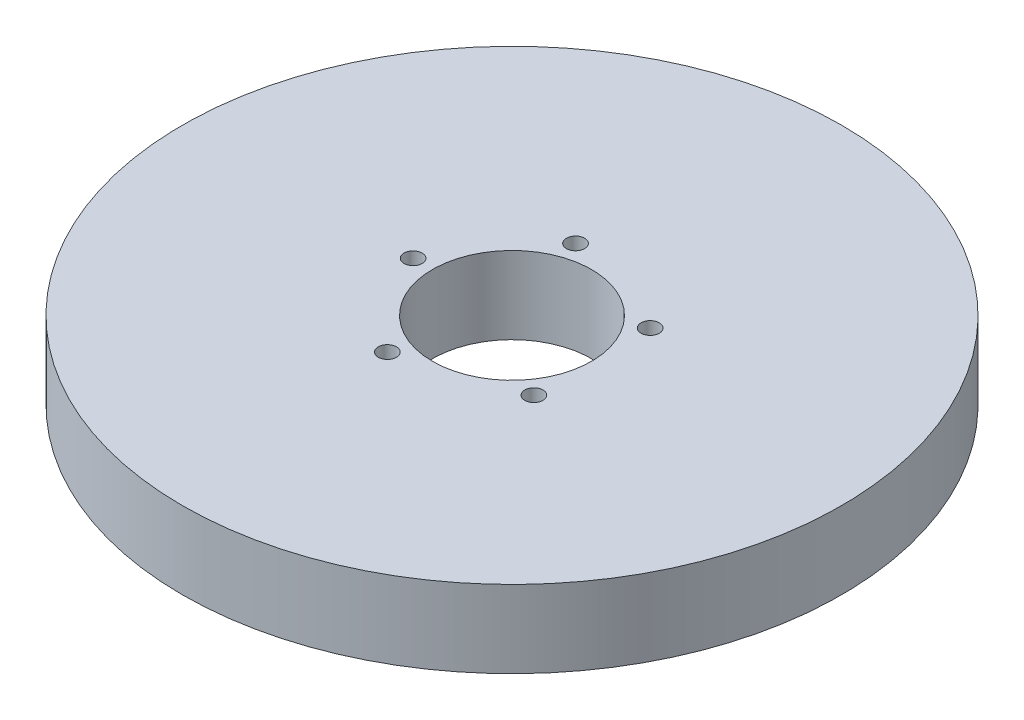
ISO-10303-21;
HEADER;
FILE_DESCRIPTION(('STEP AP214'),'2;1');
FILE_NAME('part.step','',(''),(''),'','','');
FILE_SCHEMA(('AUTOMOTIVE_DESIGN { 1 0 10303 214 1 1 1 1 }'));
ENDSEC;
DATA;
#1=APPLICATION_CONTEXT('core data for automotive mechanical design processes');
#2=APPLICATION_PROTOCOL_DEFINITION('international standard','automotive_design',2000,#1);
#3=PRODUCT_CONTEXT('',#1,'mechanical');
#4=PRODUCT('Part','Part','',(#3));
#5=PRODUCT_RELATED_PRODUCT_CATEGORY('part','',(#4));
#6=PRODUCT_DEFINITION_FORMATION('','',#4);
#7=PRODUCT_DEFINITION_CONTEXT('part definition',#1,'design');
#8=PRODUCT_DEFINITION('design','',#6,#7);
#9=PRODUCT_DEFINITION_SHAPE('','',#8);
#10=(LENGTH_UNIT() NAMED_UNIT(*) SI_UNIT(.MILLI.,.METRE.));
#11=(NAMED_UNIT(*) PLANE_ANGLE_UNIT() SI_UNIT($,.RADIAN.));
#12=(NAMED_UNIT(*) SI_UNIT($,.STERADIAN.) SOLID_ANGLE_UNIT());
#13=UNCERTAINTY_MEASURE_WITH_UNIT(LENGTH_MEASURE(1.E-05),#10,'distance_accuracy_value','');
#14=(GEOMETRIC_REPRESENTATION_CONTEXT(3) GLOBAL_UNCERTAINTY_ASSIGNED_CONTEXT((#13)) GLOBAL_UNIT_ASSIGNED_CONTEXT((#10,
#11,#12)) REPRESENTATION_CONTEXT('',''));
#15=CARTESIAN_POINT('',(0.,0.,0.));
#16=DIRECTION('',(0.,0.,1.));
#17=DIRECTION('',(1.,0.,0.));
#18=AXIS2_PLACEMENT_3D('',#15,#16,#17);
#19=CARTESIAN_POINT('',(0.,17.,0.));
#20=DIRECTION('',(0.,-1.,0.));
#21=DIRECTION('',(0.,0.,-1.));
#22=AXIS2_PLACEMENT_3D('',#19,#20,#21);
#23=CYLINDRICAL_SURFACE('',#22,72.5);
#24=CARTESIAN_POINT('',(0.,17.,0.));
#25=DIRECTION('',(0.,1.,0.));
#26=DIRECTION('',(0.,0.,1.));
#27=AXIS2_PLACEMENT_3D('',#24,#25,#26);
#28=CIRCLE('',#27,72.5);
#29=CARTESIAN_POINT('',(0.,17.,72.5));
#30=VERTEX_POINT('',#29);
#31=EDGE_CURVE('E10',#30,#30,#28,.T.);
#32=ORIENTED_EDGE('',*,*,#31,.F.);
#33=EDGE_LOOP('',(#32));
#34=FACE_BOUND('',#33,.T.);
#35=CARTESIAN_POINT('',(0.,0.,0.));
#36=DIRECTION('',(0.,1.,0.));
#37=DIRECTION('',(0.,0.,1.));
#38=AXIS2_PLACEMENT_3D('',#35,#36,#37);
#39=CIRCLE('',#38,72.5);
#40=CARTESIAN_POINT('',(0.,0.,72.5));
#41=VERTEX_POINT('',#40);
#42=EDGE_CURVE('E37',#41,#41,#39,.T.);
#43=ORIENTED_EDGE('',*,*,#42,.T.);
#44=EDGE_LOOP('',(#43));
#45=FACE_BOUND('',#44,.T.);
#46=ADVANCED_FACE('F40',(#34,#45),#23,.T.);
#47=CARTESIAN_POINT('',(0.,17.,0.));
#48=DIRECTION('',(0.,1.,0.));
#49=DIRECTION('',(0.,0.,1.));
#50=AXIS2_PLACEMENT_3D('',#47,#48,#49);
#51=PLANE('',#50);
#52=CARTESIAN_POINT('',(-6.72518779396401,17.,20.6979997578952));
#53=DIRECTION('',(0.,1.,0.));
#54=DIRECTION('',(0.951056516295155,0.,0.309016994374945));
#55=AXIS2_PLACEMENT_3D('',#52,#53,#54);
#56=CIRCLE('',#55,1.99782751471062);
#57=CARTESIAN_POINT('',(-4.82514091766473,17.,21.3153624117706));
#58=VERTEX_POINT('',#57);
#59=EDGE_CURVE('E78',#58,#58,#56,.T.);
#60=ORIENTED_EDGE('',*,*,#59,.F.);
#61=EDGE_LOOP('',(#60));
#62=FACE_BOUND('',#61,.T.);
#63=CARTESIAN_POINT('',(17.6067702253239,17.,12.7920673495162));
#64=DIRECTION('',(0.,1.,0.));
#65=DIRECTION('',(0.587785252292469,0.,-0.809016994374951));
#66=AXIS2_PLACEMENT_3D('',#63,#64,#65);
#67=CIRCLE('',#66,1.99782751471062);
#68=CARTESIAN_POINT('',(18.7810637750949,17.,11.1757909382855));
#69=VERTEX_POINT('',#68);
#70=EDGE_CURVE('E71',#69,#69,#67,.T.);
#71=ORIENTED_EDGE('',*,*,#70,.F.);
#72=EDGE_LOOP('',(#71));
#73=FACE_BOUND('',#72,.T.);
#74=CARTESIAN_POINT('',(17.6067702253237,17.,-12.7920673495165));
#75=DIRECTION('',(0.,1.,0.));
#76=DIRECTION('',(-0.58778525229248,0.,-0.809016994374942));
#77=AXIS2_PLACEMENT_3D('',#74,#75,#76);
#78=CIRCLE('',#77,1.99782751471062);
#79=CARTESIAN_POINT('',(16.4324766755527,17.,-14.4083437607472));
#80=VERTEX_POINT('',#79);
#81=EDGE_CURVE('E70',#80,#80,#78,.T.);
#82=ORIENTED_EDGE('',*,*,#81,.F.);
#83=EDGE_LOOP('',(#82));
#84=FACE_BOUND('',#83,.T.);
#85=CARTESIAN_POINT('',(-6.7251877939643,17.,-20.6979997578951));
#86=DIRECTION('',(0.,1.,0.));
#87=DIRECTION('',(-0.95105651629515,0.,0.309016994374958));
#88=AXIS2_PLACEMENT_3D('',#85,#86,#87);
#89=CIRCLE('',#88,1.99782751471062);
#90=CARTESIAN_POINT('',(-8.62523467026358,17.,-20.0806371040196));
#91=VERTEX_POINT('',#90);
#92=EDGE_CURVE('E61',#91,#91,#89,.T.);
#93=ORIENTED_EDGE('',*,*,#92,.F.);
#94=EDGE_LOOP('',(#93));
#95=FACE_BOUND('',#94,.T.);
#96=CARTESIAN_POINT('',(-21.7631648627196,17.,0.));
#97=DIRECTION('',(0.,1.,0.));
#98=DIRECTION('',(0.,0.,1.));
#99=AXIS2_PLACEMENT_3D('',#96,#97,#98);
#100=CIRCLE('',#99,1.99782751471062);
#101=CARTESIAN_POINT('',(-21.7631648627196,17.,1.99782751471062));
#102=VERTEX_POINT('',#101);
#103=EDGE_CURVE('E54',#102,#102,#100,.T.);
#104=ORIENTED_EDGE('',*,*,#103,.F.);
#105=EDGE_LOOP('',(#104));
#106=FACE_BOUND('',#105,.T.);
#107=CARTESIAN_POINT('',(0.,17.,0.));
#108=DIRECTION('',(0.,1.,0.));
#109=DIRECTION('',(0.,0.,1.));
#110=AXIS2_PLACEMENT_3D('',#107,#108,#109);
#111=CIRCLE('',#110,17.5);
#112=CARTESIAN_POINT('',(0.,17.,17.5));
#113=VERTEX_POINT('',#112);
#114=EDGE_CURVE('E50',#113,#113,#111,.T.);
#115=ORIENTED_EDGE('',*,*,#114,.F.);
#116=EDGE_LOOP('',(#115));
#117=FACE_BOUND('',#116,.T.);
#118=ORIENTED_EDGE('',*,*,#31,.T.);
#119=EDGE_LOOP('',(#118));
#120=FACE_BOUND('',#119,.T.);
#121=ADVANCED_FACE('F94',(#62,#73,#84,#95,#106,#117,#120),#51,.T.);
#122=CARTESIAN_POINT('',(0.,0.,0.));
#123=DIRECTION('',(0.,1.,0.));
#124=DIRECTION('',(0.,0.,1.));
#125=AXIS2_PLACEMENT_3D('',#122,#123,#124);
#126=PLANE('',#125);
#127=CARTESIAN_POINT('',(0.,0.,0.));
#128=DIRECTION('',(0.,1.,0.));
#129=DIRECTION('',(0.,0.,1.));
#130=AXIS2_PLACEMENT_3D('',#127,#128,#129);
#131=CIRCLE('',#130,17.5);
#132=CARTESIAN_POINT('',(0.,0.,17.5));
#133=VERTEX_POINT('',#132);
#134=EDGE_CURVE('E47',#133,#133,#131,.T.);
#135=ORIENTED_EDGE('',*,*,#134,.T.);
#136=EDGE_LOOP('',(#135));
#137=FACE_BOUND('',#136,.T.);
#138=ORIENTED_EDGE('',*,*,#42,.F.);
#139=EDGE_LOOP('',(#138));
#140=FACE_BOUND('',#139,.T.);
#141=ADVANCED_FACE('F100',(#137,#140),#126,.F.);
#142=CARTESIAN_POINT('',(0.,17.,0.));
#143=DIRECTION('',(0.,-1.,0.));
#144=DIRECTION('',(0.,0.,-1.));
#145=AXIS2_PLACEMENT_3D('',#142,#143,#144);
#146=CYLINDRICAL_SURFACE('',#145,17.5);
#147=ORIENTED_EDGE('',*,*,#114,.T.);
#148=EDGE_LOOP('',(#147));
#149=FACE_BOUND('',#148,.T.);
#150=ORIENTED_EDGE('',*,*,#134,.F.);
#151=EDGE_LOOP('',(#150));
#152=FACE_BOUND('',#151,.T.);
#153=ADVANCED_FACE('F108',(#149,#152),#146,.F.);
#154=CARTESIAN_POINT('',(-21.7631648627196,4.85249999331129,0.));
#155=DIRECTION('',(0.,1.,0.));
#156=DIRECTION('',(0.,0.,1.));
#157=AXIS2_PLACEMENT_3D('',#154,#155,#156);
#158=CYLINDRICAL_SURFACE('',#157,1.99782751471062);
#159=CARTESIAN_POINT('',(-21.7631648627196,4.85249999331129,0.));
#160=DIRECTION('',(0.,1.,0.));
#161=DIRECTION('',(0.,0.,1.));
#162=AXIS2_PLACEMENT_3D('',#159,#160,#161);
#163=CIRCLE('',#162,1.99782751471062);
#164=CARTESIAN_POINT('',(-21.7631648627196,4.85249999331129,1.99782751471062));
#165=VERTEX_POINT('',#164);
#166=EDGE_CURVE('E55',#165,#165,#163,.T.);
#167=ORIENTED_EDGE('',*,*,#166,.F.);
#168=EDGE_LOOP('',(#167));
#169=FACE_BOUND('',#168,.T.);
#170=ORIENTED_EDGE('',*,*,#103,.T.);
#171=EDGE_LOOP('',(#170));
#172=FACE_BOUND('',#171,.T.);
#173=ADVANCED_FACE('F115',(#169,#172),#158,.F.);
#174=CARTESIAN_POINT('',(-21.7631648627196,4.85249999331129,0.));
#175=DIRECTION('',(0.,1.,0.));
#176=DIRECTION('',(0.,0.,1.));
#177=AXIS2_PLACEMENT_3D('',#174,#175,#176);
#178=PLANE('',#177);
#179=ORIENTED_EDGE('',*,*,#166,.T.);
#180=EDGE_LOOP('',(#179));
#181=FACE_BOUND('',#180,.T.);
#182=ADVANCED_FACE('F142',(#181),#178,.T.);
#183=CARTESIAN_POINT('',(-6.7251877939643,4.85249999331129,-20.6979997578951));
#184=DIRECTION('',(0.,1.,0.));
#185=DIRECTION('',(0.,0.,1.));
#186=AXIS2_PLACEMENT_3D('',#183,#184,#185);
#187=CYLINDRICAL_SURFACE('',#186,1.99782751471062);
#188=CARTESIAN_POINT('',(-6.7251877939643,4.85249999331129,-20.6979997578951));
#189=DIRECTION('',(0.,1.,0.));
#190=DIRECTION('',(-0.95105651629515,0.,0.309016994374958));
#191=AXIS2_PLACEMENT_3D('',#188,#189,#190);
#192=CIRCLE('',#191,1.99782751471062);
#193=CARTESIAN_POINT('',(-8.62523467026358,4.85249999331129,-20.0806371040196));
#194=VERTEX_POINT('',#193);
#195=EDGE_CURVE('E63',#194,#194,#192,.T.);
#196=ORIENTED_EDGE('',*,*,#195,.F.);
#197=EDGE_LOOP('',(#196));
#198=FACE_BOUND('',#197,.T.);
#199=ORIENTED_EDGE('',*,*,#92,.T.);
#200=EDGE_LOOP('',(#199));
#201=FACE_BOUND('',#200,.T.);
#202=ADVANCED_FACE('F147',(#198,#201),#187,.F.);
#203=CARTESIAN_POINT('',(-6.7251877939643,4.85249999331129,-20.6979997578951));
#204=DIRECTION('',(0.,1.,0.));
#205=DIRECTION('',(-0.95105651629515,0.,0.309016994374958));
#206=AXIS2_PLACEMENT_3D('',#203,#204,#205);
#207=PLANE('',#206);
#208=ORIENTED_EDGE('',*,*,#195,.T.);
#209=EDGE_LOOP('',(#208));
#210=FACE_BOUND('',#209,.T.);
#211=ADVANCED_FACE('F163',(#210),#207,.T.);
#212=CARTESIAN_POINT('',(17.6067702253237,4.85249999331129,-12.7920673495165));
#213=DIRECTION('',(0.,1.,0.));
#214=DIRECTION('',(0.,0.,1.));
#215=AXIS2_PLACEMENT_3D('',#212,#213,#214);
#216=CYLINDRICAL_SURFACE('',#215,1.99782751471062);
#217=CARTESIAN_POINT('',(17.6067702253237,4.85249999331129,-12.7920673495165));
#218=DIRECTION('',(0.,1.,0.));
#219=DIRECTION('',(-0.58778525229248,0.,-0.809016994374942));
#220=AXIS2_PLACEMENT_3D('',#217,#218,#219);
#221=CIRCLE('',#220,1.99782751471062);
#222=CARTESIAN_POINT('',(16.4324766755527,4.85249999331129,-14.4083437607472));
#223=VERTEX_POINT('',#222);
#224=EDGE_CURVE('E69',#223,#223,#221,.T.);
#225=ORIENTED_EDGE('',*,*,#224,.F.);
#226=EDGE_LOOP('',(#225));
#227=FACE_BOUND('',#226,.T.);
#228=ORIENTED_EDGE('',*,*,#81,.T.);
#229=EDGE_LOOP('',(#228));
#230=FACE_BOUND('',#229,.T.);
#231=ADVANCED_FACE('F172',(#227,#230),#216,.F.);
#232=CARTESIAN_POINT('',(17.6067702253237,4.85249999331129,-12.7920673495165));
#233=DIRECTION('',(0.,1.,0.));
#234=DIRECTION('',(-0.58778525229248,0.,-0.809016994374942));
#235=AXIS2_PLACEMENT_3D('',#232,#233,#234);
#236=PLANE('',#235);
#237=ORIENTED_EDGE('',*,*,#224,.T.);
#238=EDGE_LOOP('',(#237));
#239=FACE_BOUND('',#238,.T.);
#240=ADVANCED_FACE('F185',(#239),#236,.T.);
#241=CARTESIAN_POINT('',(17.6067702253239,4.85249999331129,12.7920673495162));
#242=DIRECTION('',(0.,1.,0.));
#243=DIRECTION('',(0.,0.,1.));
#244=AXIS2_PLACEMENT_3D('',#241,#242,#243);
#245=CYLINDRICAL_SURFACE('',#244,1.99782751471062);
#246=CARTESIAN_POINT('',(17.6067702253239,4.85249999331129,12.7920673495162));
#247=DIRECTION('',(0.,1.,0.));
#248=DIRECTION('',(0.587785252292469,0.,-0.809016994374951));
#249=AXIS2_PLACEMENT_3D('',#246,#247,#248);
#250=CIRCLE('',#249,1.99782751471062);
#251=CARTESIAN_POINT('',(18.7810637750949,4.85249999331129,11.1757909382855));
#252=VERTEX_POINT('',#251);
#253=EDGE_CURVE('E76',#252,#252,#250,.T.);
#254=ORIENTED_EDGE('',*,*,#253,.F.);
#255=EDGE_LOOP('',(#254));
#256=FACE_BOUND('',#255,.T.);
#257=ORIENTED_EDGE('',*,*,#70,.T.);
#258=EDGE_LOOP('',(#257));
#259=FACE_BOUND('',#258,.T.);
#260=ADVANCED_FACE('F191',(#256,#259),#245,.F.);
#261=CARTESIAN_POINT('',(17.6067702253239,4.85249999331129,12.7920673495162));
#262=DIRECTION('',(0.,1.,0.));
#263=DIRECTION('',(0.587785252292469,0.,-0.809016994374951));
#264=AXIS2_PLACEMENT_3D('',#261,#262,#263);
#265=PLANE('',#264);
#266=ORIENTED_EDGE('',*,*,#253,.T.);
#267=EDGE_LOOP('',(#266));
#268=FACE_BOUND('',#267,.T.);
#269=ADVANCED_FACE('F89',(#268),#265,.T.);
#270=CARTESIAN_POINT('',(-6.72518779396401,4.85249999331129,20.6979997578952));
#271=DIRECTION('',(0.,1.,0.));
#272=DIRECTION('',(0.,0.,1.));
#273=AXIS2_PLACEMENT_3D('',#270,#271,#272);
#274=CYLINDRICAL_SURFACE('',#273,1.99782751471062);
#275=CARTESIAN_POINT('',(-6.72518779396401,4.85249999331129,20.6979997578952));
#276=DIRECTION('',(0.,1.,0.));
#277=DIRECTION('',(0.951056516295155,0.,0.309016994374945));
#278=AXIS2_PLACEMENT_3D('',#275,#276,#277);
#279=CIRCLE('',#278,1.99782751471062);
#280=CARTESIAN_POINT('',(-4.82514091766473,4.85249999331129,21.3153624117706));
#281=VERTEX_POINT('',#280);
#282=EDGE_CURVE('E59',#281,#281,#279,.T.);
#283=ORIENTED_EDGE('',*,*,#282,.F.);
#284=EDGE_LOOP('',(#283));
#285=FACE_BOUND('',#284,.T.);
#286=ORIENTED_EDGE('',*,*,#59,.T.);
#287=EDGE_LOOP('',(#286));
#288=FACE_BOUND('',#287,.T.);
#289=ADVANCED_FACE('F87',(#285,#288),#274,.F.);
#290=CARTESIAN_POINT('',(-6.72518779396401,4.85249999331129,20.6979997578952));
#291=DIRECTION('',(0.,1.,0.));
#292=DIRECTION('',(0.951056516295155,0.,0.309016994374945));
#293=AXIS2_PLACEMENT_3D('',#290,#291,#292);
#294=PLANE('',#293);
#295=ORIENTED_EDGE('',*,*,#282,.T.);
#296=EDGE_LOOP('',(#295));
#297=FACE_BOUND('',#296,.T.);
#298=ADVANCED_FACE('F84',(#297),#294,.T.);
#299=CLOSED_SHELL('',(#46,#121,#141,#153,#173,#182,#202,#211,#231,#240,#260,#269,#289,#298));
#300=MANIFOLD_SOLID_BREP('B2',#299);
#301=ADVANCED_BREP_SHAPE_REPRESENTATION('',(#18,#300),#14);
#302=SHAPE_DEFINITION_REPRESENTATION(#9,#301);
ENDSEC;
END-ISO-10303-21;
